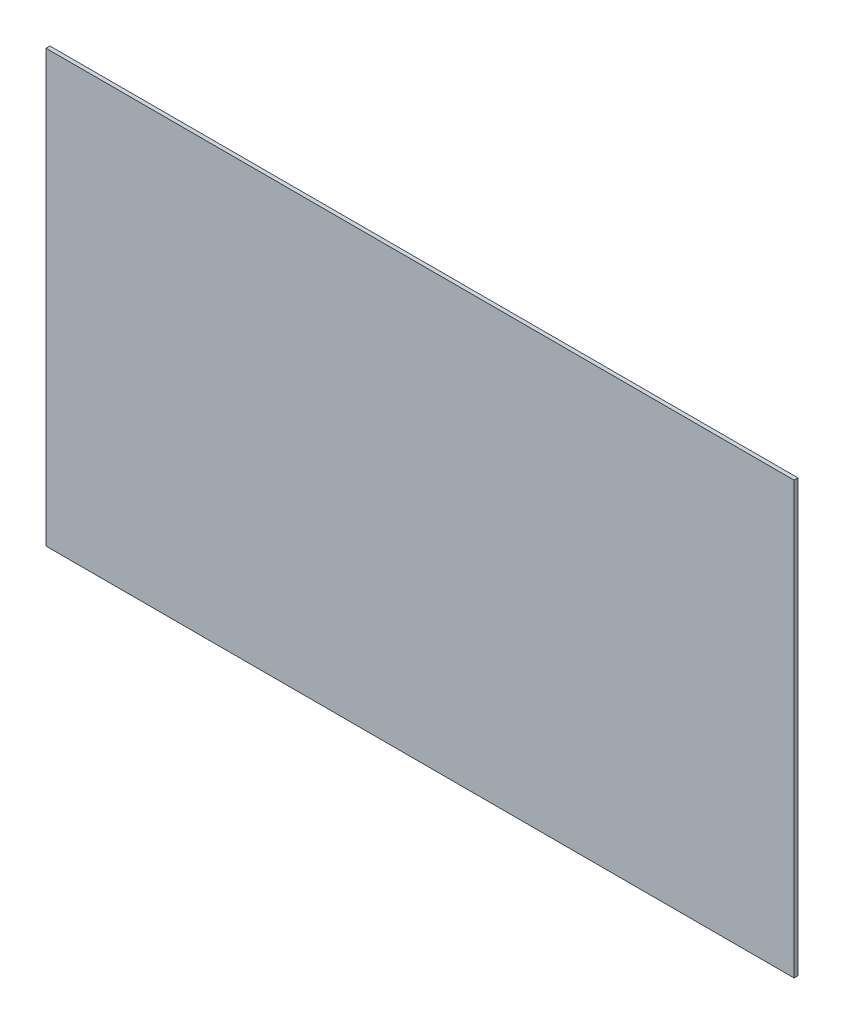
ISO-10303-21;
HEADER;
FILE_DESCRIPTION(('STEP AP214'),'2;1');
FILE_NAME('part.step','',(''),(''),'','','');
FILE_SCHEMA(('AUTOMOTIVE_DESIGN { 1 0 10303 214 1 1 1 1 }'));
ENDSEC;
DATA;
#1=APPLICATION_CONTEXT('core data for automotive mechanical design processes');
#2=APPLICATION_PROTOCOL_DEFINITION('international standard','automotive_design',2000,#1);
#3=PRODUCT_CONTEXT('',#1,'mechanical');
#4=PRODUCT('Part','Part','',(#3));
#5=PRODUCT_RELATED_PRODUCT_CATEGORY('part','',(#4));
#6=PRODUCT_DEFINITION_FORMATION('','',#4);
#7=PRODUCT_DEFINITION_CONTEXT('part definition',#1,'design');
#8=PRODUCT_DEFINITION('design','',#6,#7);
#9=PRODUCT_DEFINITION_SHAPE('','',#8);
#10=(LENGTH_UNIT() NAMED_UNIT(*) SI_UNIT(.MILLI.,.METRE.));
#11=(NAMED_UNIT(*) PLANE_ANGLE_UNIT() SI_UNIT($,.RADIAN.));
#12=(NAMED_UNIT(*) SI_UNIT($,.STERADIAN.) SOLID_ANGLE_UNIT());
#13=UNCERTAINTY_MEASURE_WITH_UNIT(LENGTH_MEASURE(1.E-05),#10,'distance_accuracy_value','');
#14=(GEOMETRIC_REPRESENTATION_CONTEXT(3) GLOBAL_UNCERTAINTY_ASSIGNED_CONTEXT((#13)) GLOBAL_UNIT_ASSIGNED_CONTEXT((#10,
#11,#12)) REPRESENTATION_CONTEXT('',''));
#15=CARTESIAN_POINT('',(0.,0.,0.));
#16=DIRECTION('',(0.,0.,1.));
#17=DIRECTION('',(1.,0.,0.));
#18=AXIS2_PLACEMENT_3D('',#15,#16,#17);
#19=CARTESIAN_POINT('',(869.997723621797,527.05,0.));
#20=DIRECTION('',(0.,0.,1.));
#21=DIRECTION('',(1.,0.,0.));
#22=AXIS2_PLACEMENT_3D('',#19,#20,#21);
#23=PLANE('',#22);
#24=DIRECTION('',(1.,0.,0.));
#25=VECTOR('',#24,1.);
#26=CARTESIAN_POINT('',(-44.4022763782031,1054.1,0.));
#27=LINE('',#26,#25);
#28=CARTESIAN_POINT('',(1784.3977236218,1054.1,0.));
#29=VERTEX_POINT('',#28);
#30=CARTESIAN_POINT('',(-44.4022763782028,1054.1,0.));
#31=VERTEX_POINT('',#30);
#32=EDGE_CURVE('E57',#29,#31,#27,.F.);
#33=ORIENTED_EDGE('',*,*,#32,.F.);
#34=DIRECTION('',(0.,1.,0.));
#35=VECTOR('',#34,1.);
#36=CARTESIAN_POINT('',(1784.3977236218,1054.1,0.));
#37=LINE('',#36,#35);
#38=CARTESIAN_POINT('',(1784.3977236218,0.,0.));
#39=VERTEX_POINT('',#38);
#40=EDGE_CURVE('E20',#39,#29,#37,.T.);
#41=ORIENTED_EDGE('',*,*,#40,.F.);
#42=DIRECTION('',(1.,0.,0.));
#43=VECTOR('',#42,1.);
#44=CARTESIAN_POINT('',(1784.3977236218,0.,0.));
#45=LINE('',#44,#43);
#46=CARTESIAN_POINT('',(-44.4022763782028,0.,0.));
#47=VERTEX_POINT('',#46);
#48=EDGE_CURVE('E79',#47,#39,#45,.T.);
#49=ORIENTED_EDGE('',*,*,#48,.F.);
#50=DIRECTION('',(0.,1.,0.));
#51=VECTOR('',#50,1.);
#52=CARTESIAN_POINT('',(-44.4022763782026,0.,0.));
#53=LINE('',#52,#51);
#54=EDGE_CURVE('E55',#31,#47,#53,.F.);
#55=ORIENTED_EDGE('',*,*,#54,.F.);
#56=EDGE_LOOP('',(#33,#41,#49,#55));
#57=FACE_BOUND('',#56,.T.);
#58=ADVANCED_FACE('F17',(#57),#23,.F.);
#59=CARTESIAN_POINT('',(1784.3977236218,1054.1,0.));
#60=DIRECTION('',(1.,0.,0.));
#61=DIRECTION('',(0.,0.,-1.));
#62=AXIS2_PLACEMENT_3D('',#59,#60,#61);
#63=PLANE('',#62);
#64=DIRECTION('',(0.,1.,0.));
#65=VECTOR('',#64,1.);
#66=CARTESIAN_POINT('',(1784.3977236218,527.05,9.525));
#67=LINE('',#66,#65);
#68=CARTESIAN_POINT('',(1784.3977236218,0.,9.525));
#69=VERTEX_POINT('',#68);
#70=CARTESIAN_POINT('',(1784.3977236218,1054.1,9.525));
#71=VERTEX_POINT('',#70);
#72=EDGE_CURVE('E83',#69,#71,#67,.T.);
#73=ORIENTED_EDGE('',*,*,#72,.F.);
#74=DIRECTION('',(0.,0.,-1.));
#75=VECTOR('',#74,1.);
#76=CARTESIAN_POINT('',(1784.3977236218,0.,0.));
#77=LINE('',#76,#75);
#78=EDGE_CURVE('E68',#39,#69,#77,.F.);
#79=ORIENTED_EDGE('',*,*,#78,.F.);
#80=ORIENTED_EDGE('',*,*,#40,.T.);
#81=DIRECTION('',(0.,0.,1.));
#82=VECTOR('',#81,1.);
#83=CARTESIAN_POINT('',(1784.3977236218,1054.1,0.));
#84=LINE('',#83,#82);
#85=EDGE_CURVE('E63',#71,#29,#84,.F.);
#86=ORIENTED_EDGE('',*,*,#85,.F.);
#87=EDGE_LOOP('',(#73,#79,#80,#86));
#88=FACE_BOUND('',#87,.T.);
#89=ADVANCED_FACE('F65',(#88),#63,.T.);
#90=CARTESIAN_POINT('',(-44.4022763782031,1054.1,0.));
#91=DIRECTION('',(0.,1.,0.));
#92=DIRECTION('',(0.,0.,1.));
#93=AXIS2_PLACEMENT_3D('',#90,#91,#92);
#94=PLANE('',#93);
#95=DIRECTION('',(1.,0.,0.));
#96=VECTOR('',#95,1.);
#97=CARTESIAN_POINT('',(869.997723621797,1054.1,9.525));
#98=LINE('',#97,#96);
#99=CARTESIAN_POINT('',(-44.4022763782027,1054.1,9.525));
#100=VERTEX_POINT('',#99);
#101=EDGE_CURVE('E72',#71,#100,#98,.F.);
#102=ORIENTED_EDGE('',*,*,#101,.F.);
#103=ORIENTED_EDGE('',*,*,#85,.T.);
#104=ORIENTED_EDGE('',*,*,#32,.T.);
#105=DIRECTION('',(0.,0.,1.));
#106=VECTOR('',#105,1.);
#107=CARTESIAN_POINT('',(-44.4022763782026,1054.1,0.));
#108=LINE('',#107,#106);
#109=EDGE_CURVE('E75',#100,#31,#108,.F.);
#110=ORIENTED_EDGE('',*,*,#109,.F.);
#111=EDGE_LOOP('',(#102,#103,#104,#110));
#112=FACE_BOUND('',#111,.T.);
#113=ADVANCED_FACE('F70',(#112),#94,.T.);
#114=CARTESIAN_POINT('',(-44.4022763782026,0.,0.));
#115=DIRECTION('',(-1.,0.,0.));
#116=DIRECTION('',(0.,0.,1.));
#117=AXIS2_PLACEMENT_3D('',#114,#115,#116);
#118=PLANE('',#117);
#119=DIRECTION('',(0.,1.,0.));
#120=VECTOR('',#119,1.);
#121=CARTESIAN_POINT('',(-44.4022763782028,527.05,9.525));
#122=LINE('',#121,#120);
#123=CARTESIAN_POINT('',(-44.4022763782027,0.,9.525));
#124=VERTEX_POINT('',#123);
#125=EDGE_CURVE('E26',#100,#124,#122,.F.);
#126=ORIENTED_EDGE('',*,*,#125,.F.);
#127=ORIENTED_EDGE('',*,*,#109,.T.);
#128=ORIENTED_EDGE('',*,*,#54,.T.);
#129=DIRECTION('',(0.,0.,-1.));
#130=VECTOR('',#129,1.);
#131=CARTESIAN_POINT('',(-44.4022763782028,0.,0.));
#132=LINE('',#131,#130);
#133=EDGE_CURVE('E35',#124,#47,#132,.T.);
#134=ORIENTED_EDGE('',*,*,#133,.F.);
#135=EDGE_LOOP('',(#126,#127,#128,#134));
#136=FACE_BOUND('',#135,.T.);
#137=ADVANCED_FACE('F89',(#136),#118,.T.);
#138=CARTESIAN_POINT('',(1784.3977236218,0.,0.));
#139=DIRECTION('',(0.,-1.,0.));
#140=DIRECTION('',(0.,0.,-1.));
#141=AXIS2_PLACEMENT_3D('',#138,#139,#140);
#142=PLANE('',#141);
#143=DIRECTION('',(1.,0.,0.));
#144=VECTOR('',#143,1.);
#145=CARTESIAN_POINT('',(869.997723621797,0.,9.525));
#146=LINE('',#145,#144);
#147=EDGE_CURVE('E11',#124,#69,#146,.T.);
#148=ORIENTED_EDGE('',*,*,#147,.F.);
#149=ORIENTED_EDGE('',*,*,#133,.T.);
#150=ORIENTED_EDGE('',*,*,#48,.T.);
#151=ORIENTED_EDGE('',*,*,#78,.T.);
#152=EDGE_LOOP('',(#148,#149,#150,#151));
#153=FACE_BOUND('',#152,.T.);
#154=ADVANCED_FACE('F91',(#153),#142,.T.);
#155=CARTESIAN_POINT('',(869.997723621797,527.05,9.525));
#156=DIRECTION('',(0.,0.,1.));
#157=DIRECTION('',(1.,0.,0.));
#158=AXIS2_PLACEMENT_3D('',#155,#156,#157);
#159=PLANE('',#158);
#160=ORIENTED_EDGE('',*,*,#125,.T.);
#161=ORIENTED_EDGE('',*,*,#147,.T.);
#162=ORIENTED_EDGE('',*,*,#72,.T.);
#163=ORIENTED_EDGE('',*,*,#101,.T.);
#164=EDGE_LOOP('',(#160,#161,#162,#163));
#165=FACE_BOUND('',#164,.T.);
#166=ADVANCED_FACE('F88',(#165),#159,.T.);
#167=CLOSED_SHELL('',(#58,#89,#113,#137,#154,#166));
#168=MANIFOLD_SOLID_BREP('B1',#167);
#169=ADVANCED_BREP_SHAPE_REPRESENTATION('',(#18,#168),#14);
#170=SHAPE_DEFINITION_REPRESENTATION(#9,#169);
ENDSEC;
END-ISO-10303-21;
